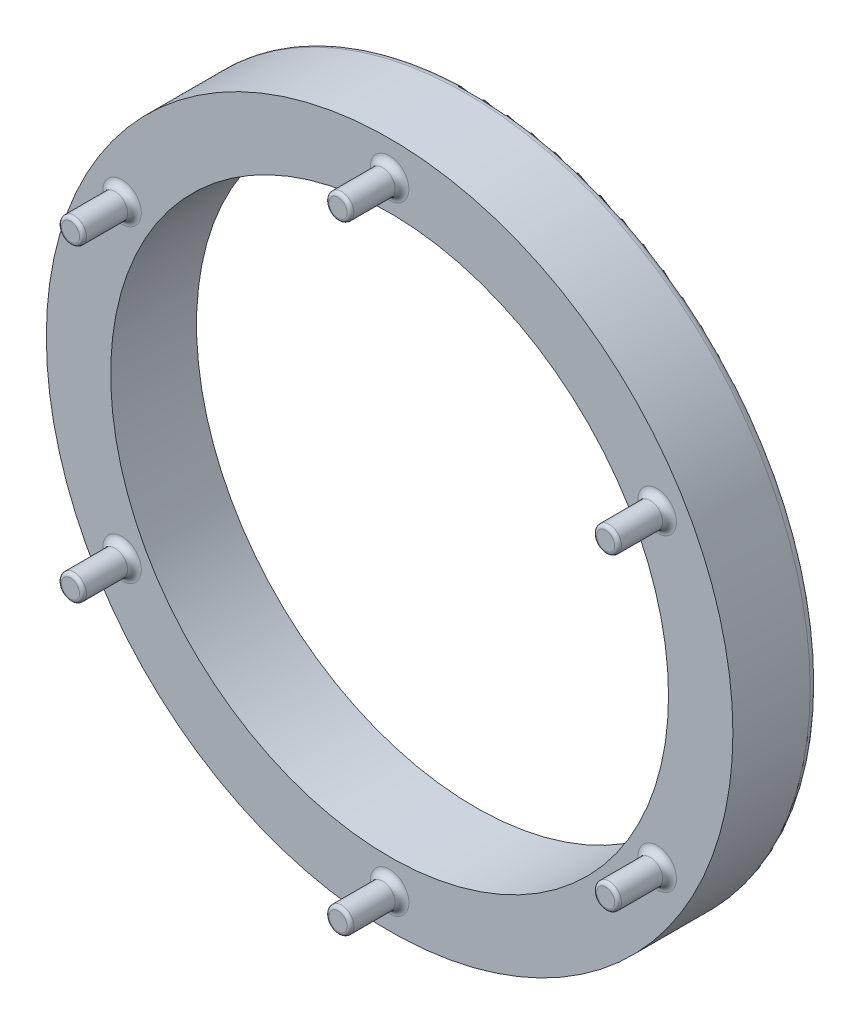
ISO-10303-21;
HEADER;
FILE_DESCRIPTION(('STEP AP214'),'2;1');
FILE_NAME('part.step','',(''),(''),'','','');
FILE_SCHEMA(('AUTOMOTIVE_DESIGN { 1 0 10303 214 1 1 1 1 }'));
ENDSEC;
DATA;
#1=APPLICATION_CONTEXT('core data for automotive mechanical design processes');
#2=APPLICATION_PROTOCOL_DEFINITION('international standard','automotive_design',2000,#1);
#3=PRODUCT_CONTEXT('',#1,'mechanical');
#4=PRODUCT('Part','Part','',(#3));
#5=PRODUCT_RELATED_PRODUCT_CATEGORY('part','',(#4));
#6=PRODUCT_DEFINITION_FORMATION('','',#4);
#7=PRODUCT_DEFINITION_CONTEXT('part definition',#1,'design');
#8=PRODUCT_DEFINITION('design','',#6,#7);
#9=PRODUCT_DEFINITION_SHAPE('','',#8);
#10=(LENGTH_UNIT() NAMED_UNIT(*) SI_UNIT(.MILLI.,.METRE.));
#11=(NAMED_UNIT(*) PLANE_ANGLE_UNIT() SI_UNIT($,.RADIAN.));
#12=(NAMED_UNIT(*) SI_UNIT($,.STERADIAN.) SOLID_ANGLE_UNIT());
#13=UNCERTAINTY_MEASURE_WITH_UNIT(LENGTH_MEASURE(1.E-05),#10,'distance_accuracy_value','');
#14=(GEOMETRIC_REPRESENTATION_CONTEXT(3) GLOBAL_UNCERTAINTY_ASSIGNED_CONTEXT((#13)) GLOBAL_UNIT_ASSIGNED_CONTEXT((#10,
#11,#12)) REPRESENTATION_CONTEXT('',''));
#15=CARTESIAN_POINT('',(0.,0.,0.));
#16=DIRECTION('',(0.,0.,1.));
#17=DIRECTION('',(1.,0.,0.));
#18=AXIS2_PLACEMENT_3D('',#15,#16,#17);
#19=CARTESIAN_POINT('',(0.,0.,5.));
#20=DIRECTION('',(0.,0.,-1.));
#21=DIRECTION('',(-1.,0.,0.));
#22=AXIS2_PLACEMENT_3D('',#19,#20,#21);
#23=CYLINDRICAL_SURFACE('',#22,20.);
#24=CARTESIAN_POINT('',(0.,0.,0.5));
#25=DIRECTION('',(0.,0.,1.));
#26=DIRECTION('',(1.,0.,0.));
#27=AXIS2_PLACEMENT_3D('',#24,#25,#26);
#28=CIRCLE('',#27,20.);
#29=CARTESIAN_POINT('',(20.,0.,0.5));
#30=VERTEX_POINT('',#29);
#31=EDGE_CURVE('E97',#30,#30,#28,.T.);
#32=ORIENTED_EDGE('',*,*,#31,.T.);
#33=EDGE_LOOP('',(#32));
#34=FACE_BOUND('',#33,.T.);
#35=CARTESIAN_POINT('',(0.,0.,5.));
#36=DIRECTION('',(0.,0.,1.));
#37=DIRECTION('',(1.,0.,0.));
#38=AXIS2_PLACEMENT_3D('',#35,#36,#37);
#39=CIRCLE('',#38,20.);
#40=CARTESIAN_POINT('',(20.,0.,5.));
#41=VERTEX_POINT('',#40);
#42=EDGE_CURVE('E149',#41,#41,#39,.T.);
#43=ORIENTED_EDGE('',*,*,#42,.F.);
#44=EDGE_LOOP('',(#43));
#45=FACE_BOUND('',#44,.T.);
#46=ADVANCED_FACE('F37',(#34,#45),#23,.T.);
#47=CARTESIAN_POINT('',(0.,0.,5.));
#48=DIRECTION('',(0.,0.,1.));
#49=DIRECTION('',(1.,0.,0.));
#50=AXIS2_PLACEMENT_3D('',#47,#48,#49);
#51=PLANE('',#50);
#52=CARTESIAN_POINT('',(0.,0.,5.));
#53=DIRECTION('',(0.,0.,1.));
#54=DIRECTION('',(1.,0.,0.));
#55=AXIS2_PLACEMENT_3D('',#52,#53,#54);
#56=CIRCLE('',#55,16.25);
#57=CARTESIAN_POINT('',(16.25,0.,5.));
#58=VERTEX_POINT('',#57);
#59=EDGE_CURVE('E153',#58,#58,#56,.T.);
#60=ORIENTED_EDGE('',*,*,#59,.F.);
#61=EDGE_LOOP('',(#60));
#62=FACE_BOUND('',#61,.T.);
#63=CARTESIAN_POINT('',(-15.5884572681184,-9.00000000000089,5.));
#64=DIRECTION('',(0.,0.,1.));
#65=DIRECTION('',(1.,0.,0.));
#66=AXIS2_PLACEMENT_3D('',#63,#64,#65);
#67=CIRCLE('',#66,1.12500000000189);
#68=CARTESIAN_POINT('',(-14.4634572681165,-9.00000000000089,5.));
#69=VERTEX_POINT('',#68);
#70=EDGE_CURVE('E121',#69,#69,#67,.F.);
#71=ORIENTED_EDGE('',*,*,#70,.T.);
#72=EDGE_LOOP('',(#71));
#73=FACE_BOUND('',#72,.T.);
#74=CARTESIAN_POINT('',(2.03974998627369E-12,-18.,5.));
#75=DIRECTION('',(0.,0.,1.));
#76=DIRECTION('',(1.,0.,0.));
#77=AXIS2_PLACEMENT_3D('',#74,#75,#76);
#78=CIRCLE('',#77,1.12500000000207);
#79=CARTESIAN_POINT('',(1.12500000000411,-18.,5.));
#80=VERTEX_POINT('',#79);
#81=EDGE_CURVE('E125',#80,#80,#78,.F.);
#82=ORIENTED_EDGE('',*,*,#81,.T.);
#83=EDGE_LOOP('',(#82));
#84=FACE_BOUND('',#83,.T.);
#85=CARTESIAN_POINT('',(15.5884572681214,-8.99999999999911,5.));
#86=DIRECTION('',(0.,0.,1.));
#87=DIRECTION('',(1.,0.,0.));
#88=AXIS2_PLACEMENT_3D('',#85,#86,#87);
#89=CIRCLE('',#88,1.12500000000129);
#90=CARTESIAN_POINT('',(16.7134572681227,-8.99999999999911,5.));
#91=VERTEX_POINT('',#90);
#92=EDGE_CURVE('E129',#91,#91,#89,.F.);
#93=ORIENTED_EDGE('',*,*,#92,.T.);
#94=EDGE_LOOP('',(#93));
#95=FACE_BOUND('',#94,.T.);
#96=CARTESIAN_POINT('',(15.5884572681204,9.00000000000089,5.));
#97=DIRECTION('',(0.,0.,1.));
#98=DIRECTION('',(1.,0.,0.));
#99=AXIS2_PLACEMENT_3D('',#96,#97,#98);
#100=CIRCLE('',#99,1.12500000000027);
#101=CARTESIAN_POINT('',(16.7134572681207,9.00000000000089,5.));
#102=VERTEX_POINT('',#101);
#103=EDGE_CURVE('E133',#102,#102,#100,.F.);
#104=ORIENTED_EDGE('',*,*,#103,.T.);
#105=EDGE_LOOP('',(#104));
#106=FACE_BOUND('',#105,.T.);
#107=CARTESIAN_POINT('',(0.,18.,5.));
#108=DIRECTION('',(0.,0.,1.));
#109=DIRECTION('',(1.,0.,0.));
#110=AXIS2_PLACEMENT_3D('',#107,#108,#109);
#111=CIRCLE('',#110,1.125);
#112=CARTESIAN_POINT('',(1.125,18.,5.));
#113=VERTEX_POINT('',#112);
#114=EDGE_CURVE('E137',#113,#113,#111,.F.);
#115=ORIENTED_EDGE('',*,*,#114,.T.);
#116=EDGE_LOOP('',(#115));
#117=FACE_BOUND('',#116,.T.);
#118=CARTESIAN_POINT('',(-15.5884572681194,8.9999999999991,5.));
#119=DIRECTION('',(0.,0.,1.));
#120=DIRECTION('',(1.,0.,0.));
#121=AXIS2_PLACEMENT_3D('',#118,#119,#120);
#122=CIRCLE('',#121,1.12500000000096);
#123=CARTESIAN_POINT('',(-14.4634572681184,8.9999999999991,5.));
#124=VERTEX_POINT('',#123);
#125=EDGE_CURVE('E141',#124,#124,#122,.F.);
#126=ORIENTED_EDGE('',*,*,#125,.T.);
#127=EDGE_LOOP('',(#126));
#128=FACE_BOUND('',#127,.T.);
#129=ORIENTED_EDGE('',*,*,#42,.T.);
#130=EDGE_LOOP('',(#129));
#131=FACE_BOUND('',#130,.T.);
#132=ADVANCED_FACE('F176',(#62,#73,#84,#95,#106,#117,#128,#131),#51,.T.);
#133=CARTESIAN_POINT('',(0.,0.,0.));
#134=DIRECTION('',(0.,0.,1.));
#135=DIRECTION('',(1.,0.,0.));
#136=AXIS2_PLACEMENT_3D('',#133,#134,#135);
#137=PLANE('',#136);
#138=CARTESIAN_POINT('',(0.,0.,0.));
#139=DIRECTION('',(0.,0.,1.));
#140=DIRECTION('',(1.,0.,0.));
#141=AXIS2_PLACEMENT_3D('',#138,#139,#140);
#142=CIRCLE('',#141,16.25);
#143=CARTESIAN_POINT('',(16.25,0.,0.));
#144=VERTEX_POINT('',#143);
#145=EDGE_CURVE('E157',#144,#144,#142,.T.);
#146=ORIENTED_EDGE('',*,*,#145,.T.);
#147=EDGE_LOOP('',(#146));
#148=FACE_BOUND('',#147,.T.);
#149=CARTESIAN_POINT('',(0.,0.,0.));
#150=DIRECTION('',(0.,0.,1.));
#151=DIRECTION('',(1.,0.,0.));
#152=AXIS2_PLACEMENT_3D('',#149,#150,#151);
#153=CIRCLE('',#152,19.5);
#154=CARTESIAN_POINT('',(19.5,0.,0.));
#155=VERTEX_POINT('',#154);
#156=EDGE_CURVE('E93',#155,#155,#153,.F.);
#157=ORIENTED_EDGE('',*,*,#156,.T.);
#158=EDGE_LOOP('',(#157));
#159=FACE_BOUND('',#158,.T.);
#160=ADVANCED_FACE('F162',(#148,#159),#137,.F.);
#161=CARTESIAN_POINT('',(0.,18.,8.));
#162=DIRECTION('',(0.,0.,-1.));
#163=DIRECTION('',(-1.,0.,0.));
#164=AXIS2_PLACEMENT_3D('',#161,#162,#163);
#165=CYLINDRICAL_SURFACE('',#164,0.725);
#166=CARTESIAN_POINT('',(0.,18.,7.8));
#167=DIRECTION('',(0.,0.,1.));
#168=DIRECTION('',(1.,0.,0.));
#169=AXIS2_PLACEMENT_3D('',#166,#167,#168);
#170=CIRCLE('',#169,0.725);
#171=CARTESIAN_POINT('',(0.725,18.,7.8));
#172=VERTEX_POINT('',#171);
#173=EDGE_CURVE('E85',#172,#172,#170,.F.);
#174=ORIENTED_EDGE('',*,*,#173,.T.);
#175=EDGE_LOOP('',(#174));
#176=FACE_BOUND('',#175,.T.);
#177=CARTESIAN_POINT('',(0.,18.,5.4));
#178=DIRECTION('',(0.,0.,1.));
#179=DIRECTION('',(1.,0.,0.));
#180=AXIS2_PLACEMENT_3D('',#177,#178,#179);
#181=CIRCLE('',#180,0.725);
#182=CARTESIAN_POINT('',(0.725,18.,5.4));
#183=VERTEX_POINT('',#182);
#184=EDGE_CURVE('E105',#183,#183,#181,.T.);
#185=ORIENTED_EDGE('',*,*,#184,.T.);
#186=EDGE_LOOP('',(#185));
#187=FACE_BOUND('',#186,.T.);
#188=ADVANCED_FACE('F272',(#176,#187),#165,.T.);
#189=CARTESIAN_POINT('',(0.,18.,8.));
#190=DIRECTION('',(0.,0.,1.));
#191=DIRECTION('',(1.,0.,0.));
#192=AXIS2_PLACEMENT_3D('',#189,#190,#191);
#193=PLANE('',#192);
#194=CARTESIAN_POINT('',(0.,18.,8.));
#195=DIRECTION('',(0.,0.,1.));
#196=DIRECTION('',(1.,0.,0.));
#197=AXIS2_PLACEMENT_3D('',#194,#195,#196);
#198=CIRCLE('',#197,0.525);
#199=CARTESIAN_POINT('',(0.525,18.,8.));
#200=VERTEX_POINT('',#199);
#201=EDGE_CURVE('E89',#200,#200,#198,.T.);
#202=ORIENTED_EDGE('',*,*,#201,.T.);
#203=EDGE_LOOP('',(#202));
#204=FACE_BOUND('',#203,.T.);
#205=ADVANCED_FACE('F269',(#204),#193,.T.);
#206=CARTESIAN_POINT('',(15.5884572681204,9.00000000000089,8.));
#207=DIRECTION('',(0.,0.,-1.));
#208=DIRECTION('',(-1.,0.,0.));
#209=AXIS2_PLACEMENT_3D('',#206,#207,#208);
#210=CYLINDRICAL_SURFACE('',#209,0.725000000000274);
#211=CARTESIAN_POINT('',(15.5884572681204,9.00000000000089,7.8));
#212=DIRECTION('',(0.,0.,1.));
#213=DIRECTION('',(1.,0.,0.));
#214=AXIS2_PLACEMENT_3D('',#211,#212,#213);
#215=CIRCLE('',#214,0.725000000000274);
#216=CARTESIAN_POINT('',(16.3134572681207,9.00000000000089,7.8));
#217=VERTEX_POINT('',#216);
#218=EDGE_CURVE('E10',#217,#217,#215,.F.);
#219=ORIENTED_EDGE('',*,*,#218,.T.);
#220=EDGE_LOOP('',(#219));
#221=FACE_BOUND('',#220,.T.);
#222=CARTESIAN_POINT('',(15.5884572681204,9.00000000000089,5.4));
#223=DIRECTION('',(0.,0.,1.));
#224=DIRECTION('',(1.,0.,0.));
#225=AXIS2_PLACEMENT_3D('',#222,#223,#224);
#226=CIRCLE('',#225,0.725000000000274);
#227=CARTESIAN_POINT('',(16.3134572681207,9.00000000000089,5.4));
#228=VERTEX_POINT('',#227);
#229=EDGE_CURVE('E109',#228,#228,#226,.T.);
#230=ORIENTED_EDGE('',*,*,#229,.T.);
#231=EDGE_LOOP('',(#230));
#232=FACE_BOUND('',#231,.T.);
#233=ADVANCED_FACE('F266',(#221,#232),#210,.T.);
#234=CARTESIAN_POINT('',(15.5884572681204,9.00000000000089,8.));
#235=DIRECTION('',(0.,0.,1.));
#236=DIRECTION('',(1.,0.,0.));
#237=AXIS2_PLACEMENT_3D('',#234,#235,#236);
#238=PLANE('',#237);
#239=CARTESIAN_POINT('',(15.5884572681204,9.00000000000089,8.));
#240=DIRECTION('',(0.,0.,1.));
#241=DIRECTION('',(1.,0.,0.));
#242=AXIS2_PLACEMENT_3D('',#239,#240,#241);
#243=CIRCLE('',#242,0.525000000000274);
#244=CARTESIAN_POINT('',(16.1134572681207,9.00000000000089,8.));
#245=VERTEX_POINT('',#244);
#246=EDGE_CURVE('E45',#245,#245,#243,.T.);
#247=ORIENTED_EDGE('',*,*,#246,.T.);
#248=EDGE_LOOP('',(#247));
#249=FACE_BOUND('',#248,.T.);
#250=ADVANCED_FACE('F262',(#249),#238,.T.);
#251=CARTESIAN_POINT('',(15.5884572681214,-8.99999999999911,8.));
#252=DIRECTION('',(0.,0.,-1.));
#253=DIRECTION('',(-1.,0.,0.));
#254=AXIS2_PLACEMENT_3D('',#251,#252,#253);
#255=CYLINDRICAL_SURFACE('',#254,0.725000000001288);
#256=CARTESIAN_POINT('',(15.5884572681214,-8.99999999999911,7.8));
#257=DIRECTION('',(0.,0.,1.));
#258=DIRECTION('',(1.,0.,0.));
#259=AXIS2_PLACEMENT_3D('',#256,#257,#258);
#260=CIRCLE('',#259,0.725000000001288);
#261=CARTESIAN_POINT('',(16.3134572681227,-8.99999999999911,7.8));
#262=VERTEX_POINT('',#261);
#263=EDGE_CURVE('E61',#262,#262,#260,.F.);
#264=ORIENTED_EDGE('',*,*,#263,.T.);
#265=EDGE_LOOP('',(#264));
#266=FACE_BOUND('',#265,.T.);
#267=CARTESIAN_POINT('',(15.5884572681214,-8.99999999999911,5.4));
#268=DIRECTION('',(0.,0.,1.));
#269=DIRECTION('',(1.,0.,0.));
#270=AXIS2_PLACEMENT_3D('',#267,#268,#269);
#271=CIRCLE('',#270,0.725000000001288);
#272=CARTESIAN_POINT('',(16.3134572681227,-8.99999999999911,5.4));
#273=VERTEX_POINT('',#272);
#274=EDGE_CURVE('E113',#273,#273,#271,.T.);
#275=ORIENTED_EDGE('',*,*,#274,.T.);
#276=EDGE_LOOP('',(#275));
#277=FACE_BOUND('',#276,.T.);
#278=ADVANCED_FACE('F258',(#266,#277),#255,.T.);
#279=CARTESIAN_POINT('',(15.5884572681214,-8.99999999999911,8.));
#280=DIRECTION('',(0.,0.,1.));
#281=DIRECTION('',(1.,0.,0.));
#282=AXIS2_PLACEMENT_3D('',#279,#280,#281);
#283=PLANE('',#282);
#284=CARTESIAN_POINT('',(15.5884572681214,-8.99999999999911,8.));
#285=DIRECTION('',(0.,0.,1.));
#286=DIRECTION('',(1.,0.,0.));
#287=AXIS2_PLACEMENT_3D('',#284,#285,#286);
#288=CIRCLE('',#287,0.525000000001288);
#289=CARTESIAN_POINT('',(16.1134572681227,-8.99999999999911,8.));
#290=VERTEX_POINT('',#289);
#291=EDGE_CURVE('E65',#290,#290,#288,.T.);
#292=ORIENTED_EDGE('',*,*,#291,.T.);
#293=EDGE_LOOP('',(#292));
#294=FACE_BOUND('',#293,.T.);
#295=ADVANCED_FACE('F251',(#294),#283,.T.);
#296=CARTESIAN_POINT('',(2.03974998627369E-12,-18.,8.));
#297=DIRECTION('',(0.,0.,-1.));
#298=DIRECTION('',(-1.,0.,0.));
#299=AXIS2_PLACEMENT_3D('',#296,#297,#298);
#300=CYLINDRICAL_SURFACE('',#299,0.725000000002071);
#301=CARTESIAN_POINT('',(2.03974998627369E-12,-18.,7.8));
#302=DIRECTION('',(0.,0.,1.));
#303=DIRECTION('',(1.,0.,0.));
#304=AXIS2_PLACEMENT_3D('',#301,#302,#303);
#305=CIRCLE('',#304,0.725000000002071);
#306=CARTESIAN_POINT('',(0.725000000004111,-18.,7.8));
#307=VERTEX_POINT('',#306);
#308=EDGE_CURVE('E50',#307,#307,#305,.F.);
#309=ORIENTED_EDGE('',*,*,#308,.T.);
#310=EDGE_LOOP('',(#309));
#311=FACE_BOUND('',#310,.T.);
#312=CARTESIAN_POINT('',(2.03974998627369E-12,-18.,5.4));
#313=DIRECTION('',(0.,0.,1.));
#314=DIRECTION('',(1.,0.,0.));
#315=AXIS2_PLACEMENT_3D('',#312,#313,#314);
#316=CIRCLE('',#315,0.725000000002071);
#317=CARTESIAN_POINT('',(0.725000000004111,-18.,5.4));
#318=VERTEX_POINT('',#317);
#319=EDGE_CURVE('E117',#318,#318,#316,.T.);
#320=ORIENTED_EDGE('',*,*,#319,.T.);
#321=EDGE_LOOP('',(#320));
#322=FACE_BOUND('',#321,.T.);
#323=ADVANCED_FACE('F242',(#311,#322),#300,.T.);
#324=CARTESIAN_POINT('',(2.03974998627369E-12,-18.,8.));
#325=DIRECTION('',(0.,0.,1.));
#326=DIRECTION('',(1.,0.,0.));
#327=AXIS2_PLACEMENT_3D('',#324,#325,#326);
#328=PLANE('',#327);
#329=CARTESIAN_POINT('',(2.03974998627369E-12,-18.,8.));
#330=DIRECTION('',(0.,0.,1.));
#331=DIRECTION('',(1.,0.,0.));
#332=AXIS2_PLACEMENT_3D('',#329,#330,#331);
#333=CIRCLE('',#332,0.525000000002071);
#334=CARTESIAN_POINT('',(0.525000000004111,-18.,8.));
#335=VERTEX_POINT('',#334);
#336=EDGE_CURVE('E55',#335,#335,#333,.T.);
#337=ORIENTED_EDGE('',*,*,#336,.T.);
#338=EDGE_LOOP('',(#337));
#339=FACE_BOUND('',#338,.T.);
#340=ADVANCED_FACE('F239',(#339),#328,.T.);
#341=CARTESIAN_POINT('',(-15.5884572681184,-9.00000000000089,8.));
#342=DIRECTION('',(0.,0.,-1.));
#343=DIRECTION('',(-1.,0.,0.));
#344=AXIS2_PLACEMENT_3D('',#341,#342,#343);
#345=CYLINDRICAL_SURFACE('',#344,0.725000000001887);
#346=CARTESIAN_POINT('',(-15.5884572681184,-9.00000000000089,7.8));
#347=DIRECTION('',(0.,0.,1.));
#348=DIRECTION('',(1.,0.,0.));
#349=AXIS2_PLACEMENT_3D('',#346,#347,#348);
#350=CIRCLE('',#349,0.725000000001887);
#351=CARTESIAN_POINT('',(-14.8634572681165,-9.00000000000089,7.8));
#352=VERTEX_POINT('',#351);
#353=EDGE_CURVE('E69',#352,#352,#350,.F.);
#354=ORIENTED_EDGE('',*,*,#353,.T.);
#355=EDGE_LOOP('',(#354));
#356=FACE_BOUND('',#355,.T.);
#357=CARTESIAN_POINT('',(-15.5884572681184,-9.00000000000089,5.4));
#358=DIRECTION('',(0.,0.,1.));
#359=DIRECTION('',(1.,0.,0.));
#360=AXIS2_PLACEMENT_3D('',#357,#358,#359);
#361=CIRCLE('',#360,0.725000000001887);
#362=CARTESIAN_POINT('',(-14.8634572681165,-9.00000000000089,5.4));
#363=VERTEX_POINT('',#362);
#364=EDGE_CURVE('E145',#363,#363,#361,.T.);
#365=ORIENTED_EDGE('',*,*,#364,.T.);
#366=EDGE_LOOP('',(#365));
#367=FACE_BOUND('',#366,.T.);
#368=ADVANCED_FACE('F241',(#356,#367),#345,.T.);
#369=CARTESIAN_POINT('',(-15.5884572681184,-9.00000000000089,8.));
#370=DIRECTION('',(0.,0.,1.));
#371=DIRECTION('',(1.,0.,0.));
#372=AXIS2_PLACEMENT_3D('',#369,#370,#371);
#373=PLANE('',#372);
#374=CARTESIAN_POINT('',(-15.5884572681184,-9.00000000000089,8.));
#375=DIRECTION('',(0.,0.,1.));
#376=DIRECTION('',(1.,0.,0.));
#377=AXIS2_PLACEMENT_3D('',#374,#375,#376);
#378=CIRCLE('',#377,0.525000000001887);
#379=CARTESIAN_POINT('',(-15.0634572681165,-9.00000000000089,8.));
#380=VERTEX_POINT('',#379);
#381=EDGE_CURVE('E73',#380,#380,#378,.T.);
#382=ORIENTED_EDGE('',*,*,#381,.T.);
#383=EDGE_LOOP('',(#382));
#384=FACE_BOUND('',#383,.T.);
#385=ADVANCED_FACE('F248',(#384),#373,.T.);
#386=CARTESIAN_POINT('',(-15.5884572681194,8.9999999999991,8.));
#387=DIRECTION('',(0.,0.,-1.));
#388=DIRECTION('',(-1.,0.,0.));
#389=AXIS2_PLACEMENT_3D('',#386,#387,#388);
#390=CYLINDRICAL_SURFACE('',#389,0.725000000000959);
#391=CARTESIAN_POINT('',(-15.5884572681194,8.9999999999991,7.8));
#392=DIRECTION('',(0.,0.,1.));
#393=DIRECTION('',(1.,0.,0.));
#394=AXIS2_PLACEMENT_3D('',#391,#392,#393);
#395=CIRCLE('',#394,0.725000000000959);
#396=CARTESIAN_POINT('',(-14.8634572681184,8.9999999999991,7.8));
#397=VERTEX_POINT('',#396);
#398=EDGE_CURVE('E77',#397,#397,#395,.F.);
#399=ORIENTED_EDGE('',*,*,#398,.T.);
#400=EDGE_LOOP('',(#399));
#401=FACE_BOUND('',#400,.T.);
#402=CARTESIAN_POINT('',(-15.5884572681194,8.9999999999991,5.4));
#403=DIRECTION('',(0.,0.,1.));
#404=DIRECTION('',(1.,0.,0.));
#405=AXIS2_PLACEMENT_3D('',#402,#403,#404);
#406=CIRCLE('',#405,0.725000000000959);
#407=CARTESIAN_POINT('',(-14.8634572681184,8.9999999999991,5.4));
#408=VERTEX_POINT('',#407);
#409=EDGE_CURVE('E101',#408,#408,#406,.T.);
#410=ORIENTED_EDGE('',*,*,#409,.T.);
#411=EDGE_LOOP('',(#410));
#412=FACE_BOUND('',#411,.T.);
#413=ADVANCED_FACE('F337',(#401,#412),#390,.T.);
#414=CARTESIAN_POINT('',(-15.5884572681194,8.9999999999991,8.));
#415=DIRECTION('',(0.,0.,1.));
#416=DIRECTION('',(1.,0.,0.));
#417=AXIS2_PLACEMENT_3D('',#414,#415,#416);
#418=PLANE('',#417);
#419=CARTESIAN_POINT('',(-15.5884572681194,8.9999999999991,8.));
#420=DIRECTION('',(0.,0.,1.));
#421=DIRECTION('',(1.,0.,0.));
#422=AXIS2_PLACEMENT_3D('',#419,#420,#421);
#423=CIRCLE('',#422,0.525000000000959);
#424=CARTESIAN_POINT('',(-15.0634572681184,8.9999999999991,8.));
#425=VERTEX_POINT('',#424);
#426=EDGE_CURVE('E81',#425,#425,#423,.T.);
#427=ORIENTED_EDGE('',*,*,#426,.T.);
#428=EDGE_LOOP('',(#427));
#429=FACE_BOUND('',#428,.T.);
#430=ADVANCED_FACE('F191',(#429),#418,.T.);
#431=CARTESIAN_POINT('',(-15.5884572681184,-9.00000000000089,5.4));
#432=DIRECTION('',(0.,0.,1.));
#433=DIRECTION('',(1.,0.,0.));
#434=AXIS2_PLACEMENT_3D('',#431,#432,#433);
#435=TOROIDAL_SURFACE('',#434,1.12500000000189,0.4);
#436=ORIENTED_EDGE('',*,*,#70,.F.);
#437=EDGE_LOOP('',(#436));
#438=FACE_BOUND('',#437,.T.);
#439=ORIENTED_EDGE('',*,*,#364,.F.);
#440=EDGE_LOOP('',(#439));
#441=FACE_BOUND('',#440,.T.);
#442=ADVANCED_FACE('F187',(#438,#441),#435,.F.);
#443=CARTESIAN_POINT('',(2.03974998627369E-12,-18.,5.4));
#444=DIRECTION('',(0.,0.,1.));
#445=DIRECTION('',(1.,0.,0.));
#446=AXIS2_PLACEMENT_3D('',#443,#444,#445);
#447=TOROIDAL_SURFACE('',#446,1.12500000000207,0.4);
#448=ORIENTED_EDGE('',*,*,#81,.F.);
#449=EDGE_LOOP('',(#448));
#450=FACE_BOUND('',#449,.T.);
#451=ORIENTED_EDGE('',*,*,#319,.F.);
#452=EDGE_LOOP('',(#451));
#453=FACE_BOUND('',#452,.T.);
#454=ADVANCED_FACE('F190',(#450,#453),#447,.F.);
#455=CARTESIAN_POINT('',(15.5884572681214,-8.99999999999911,5.4));
#456=DIRECTION('',(0.,0.,1.));
#457=DIRECTION('',(1.,0.,0.));
#458=AXIS2_PLACEMENT_3D('',#455,#456,#457);
#459=TOROIDAL_SURFACE('',#458,1.12500000000129,0.4);
#460=ORIENTED_EDGE('',*,*,#92,.F.);
#461=EDGE_LOOP('',(#460));
#462=FACE_BOUND('',#461,.T.);
#463=ORIENTED_EDGE('',*,*,#274,.F.);
#464=EDGE_LOOP('',(#463));
#465=FACE_BOUND('',#464,.T.);
#466=ADVANCED_FACE('F195',(#462,#465),#459,.F.);
#467=CARTESIAN_POINT('',(15.5884572681204,9.00000000000089,5.4));
#468=DIRECTION('',(0.,0.,1.));
#469=DIRECTION('',(1.,0.,0.));
#470=AXIS2_PLACEMENT_3D('',#467,#468,#469);
#471=TOROIDAL_SURFACE('',#470,1.12500000000027,0.4);
#472=ORIENTED_EDGE('',*,*,#103,.F.);
#473=EDGE_LOOP('',(#472));
#474=FACE_BOUND('',#473,.T.);
#475=ORIENTED_EDGE('',*,*,#229,.F.);
#476=EDGE_LOOP('',(#475));
#477=FACE_BOUND('',#476,.T.);
#478=ADVANCED_FACE('F199',(#474,#477),#471,.F.);
#479=CARTESIAN_POINT('',(0.,18.,5.4));
#480=DIRECTION('',(0.,0.,1.));
#481=DIRECTION('',(1.,0.,0.));
#482=AXIS2_PLACEMENT_3D('',#479,#480,#481);
#483=TOROIDAL_SURFACE('',#482,1.125,0.4);
#484=ORIENTED_EDGE('',*,*,#114,.F.);
#485=EDGE_LOOP('',(#484));
#486=FACE_BOUND('',#485,.T.);
#487=ORIENTED_EDGE('',*,*,#184,.F.);
#488=EDGE_LOOP('',(#487));
#489=FACE_BOUND('',#488,.T.);
#490=ADVANCED_FACE('F203',(#486,#489),#483,.F.);
#491=CARTESIAN_POINT('',(-15.5884572681194,8.9999999999991,5.4));
#492=DIRECTION('',(0.,0.,1.));
#493=DIRECTION('',(1.,0.,0.));
#494=AXIS2_PLACEMENT_3D('',#491,#492,#493);
#495=TOROIDAL_SURFACE('',#494,1.12500000000096,0.4);
#496=ORIENTED_EDGE('',*,*,#125,.F.);
#497=EDGE_LOOP('',(#496));
#498=FACE_BOUND('',#497,.T.);
#499=ORIENTED_EDGE('',*,*,#409,.F.);
#500=EDGE_LOOP('',(#499));
#501=FACE_BOUND('',#500,.T.);
#502=ADVANCED_FACE('F207',(#498,#501),#495,.F.);
#503=CARTESIAN_POINT('',(0.,0.,0.5));
#504=DIRECTION('',(0.,0.,1.));
#505=DIRECTION('',(1.,0.,0.));
#506=AXIS2_PLACEMENT_3D('',#503,#504,#505);
#507=TOROIDAL_SURFACE('',#506,19.5,0.5);
#508=ORIENTED_EDGE('',*,*,#156,.F.);
#509=EDGE_LOOP('',(#508));
#510=FACE_BOUND('',#509,.T.);
#511=ORIENTED_EDGE('',*,*,#31,.F.);
#512=EDGE_LOOP('',(#511));
#513=FACE_BOUND('',#512,.T.);
#514=ADVANCED_FACE('F211',(#510,#513),#507,.T.);
#515=CARTESIAN_POINT('',(0.,18.,7.8));
#516=DIRECTION('',(0.,0.,1.));
#517=DIRECTION('',(1.,0.,0.));
#518=AXIS2_PLACEMENT_3D('',#515,#516,#517);
#519=TOROIDAL_SURFACE('',#518,0.525,0.2);
#520=ORIENTED_EDGE('',*,*,#173,.F.);
#521=EDGE_LOOP('',(#520));
#522=FACE_BOUND('',#521,.T.);
#523=ORIENTED_EDGE('',*,*,#201,.F.);
#524=EDGE_LOOP('',(#523));
#525=FACE_BOUND('',#524,.T.);
#526=ADVANCED_FACE('F215',(#522,#525),#519,.T.);
#527=CARTESIAN_POINT('',(-15.5884572681194,8.9999999999991,7.8));
#528=DIRECTION('',(0.,0.,1.));
#529=DIRECTION('',(1.,0.,0.));
#530=AXIS2_PLACEMENT_3D('',#527,#528,#529);
#531=TOROIDAL_SURFACE('',#530,0.525000000000959,0.2);
#532=ORIENTED_EDGE('',*,*,#398,.F.);
#533=EDGE_LOOP('',(#532));
#534=FACE_BOUND('',#533,.T.);
#535=ORIENTED_EDGE('',*,*,#426,.F.);
#536=EDGE_LOOP('',(#535));
#537=FACE_BOUND('',#536,.T.);
#538=ADVANCED_FACE('F219',(#534,#537),#531,.T.);
#539=CARTESIAN_POINT('',(-15.5884572681184,-9.00000000000089,7.8));
#540=DIRECTION('',(0.,0.,1.));
#541=DIRECTION('',(1.,0.,0.));
#542=AXIS2_PLACEMENT_3D('',#539,#540,#541);
#543=TOROIDAL_SURFACE('',#542,0.525000000001887,0.2);
#544=ORIENTED_EDGE('',*,*,#353,.F.);
#545=EDGE_LOOP('',(#544));
#546=FACE_BOUND('',#545,.T.);
#547=ORIENTED_EDGE('',*,*,#381,.F.);
#548=EDGE_LOOP('',(#547));
#549=FACE_BOUND('',#548,.T.);
#550=ADVANCED_FACE('F223',(#546,#549),#543,.T.);
#551=CARTESIAN_POINT('',(15.5884572681214,-8.99999999999911,7.8));
#552=DIRECTION('',(0.,0.,1.));
#553=DIRECTION('',(1.,0.,0.));
#554=AXIS2_PLACEMENT_3D('',#551,#552,#553);
#555=TOROIDAL_SURFACE('',#554,0.525000000001288,0.2);
#556=ORIENTED_EDGE('',*,*,#263,.F.);
#557=EDGE_LOOP('',(#556));
#558=FACE_BOUND('',#557,.T.);
#559=ORIENTED_EDGE('',*,*,#291,.F.);
#560=EDGE_LOOP('',(#559));
#561=FACE_BOUND('',#560,.T.);
#562=ADVANCED_FACE('F227',(#558,#561),#555,.T.);
#563=CARTESIAN_POINT('',(2.03974998627369E-12,-18.,7.8));
#564=DIRECTION('',(0.,0.,1.));
#565=DIRECTION('',(1.,0.,0.));
#566=AXIS2_PLACEMENT_3D('',#563,#564,#565);
#567=TOROIDAL_SURFACE('',#566,0.525000000002071,0.2);
#568=ORIENTED_EDGE('',*,*,#308,.F.);
#569=EDGE_LOOP('',(#568));
#570=FACE_BOUND('',#569,.T.);
#571=ORIENTED_EDGE('',*,*,#336,.F.);
#572=EDGE_LOOP('',(#571));
#573=FACE_BOUND('',#572,.T.);
#574=ADVANCED_FACE('F172',(#570,#573),#567,.T.);
#575=CARTESIAN_POINT('',(15.5884572681204,9.00000000000089,7.8));
#576=DIRECTION('',(0.,0.,1.));
#577=DIRECTION('',(1.,0.,0.));
#578=AXIS2_PLACEMENT_3D('',#575,#576,#577);
#579=TOROIDAL_SURFACE('',#578,0.525000000000274,0.2);
#580=ORIENTED_EDGE('',*,*,#218,.F.);
#581=EDGE_LOOP('',(#580));
#582=FACE_BOUND('',#581,.T.);
#583=ORIENTED_EDGE('',*,*,#246,.F.);
#584=EDGE_LOOP('',(#583));
#585=FACE_BOUND('',#584,.T.);
#586=ADVANCED_FACE('F39',(#582,#585),#579,.T.);
#587=CARTESIAN_POINT('',(0.,0.,4.));
#588=DIRECTION('',(0.,0.,1.));
#589=DIRECTION('',(1.,0.,0.));
#590=AXIS2_PLACEMENT_3D('',#587,#588,#589);
#591=CYLINDRICAL_SURFACE('',#590,16.25);
#592=ORIENTED_EDGE('',*,*,#59,.T.);
#593=EDGE_LOOP('',(#592));
#594=FACE_BOUND('',#593,.T.);
#595=ORIENTED_EDGE('',*,*,#145,.F.);
#596=EDGE_LOOP('',(#595));
#597=FACE_BOUND('',#596,.T.);
#598=ADVANCED_FACE('F165',(#594,#597),#591,.F.);
#599=CLOSED_SHELL('',(#46,#132,#160,#188,#205,#233,#250,#278,#295,#323,#340,#368,#385,#413,#430,
#442,#454,#466,#478,#490,#502,#514,#526,#538,#550,#562,#574,#586,#598));
#600=MANIFOLD_SOLID_BREP('B2',#599);
#601=ADVANCED_BREP_SHAPE_REPRESENTATION('',(#18,#600),#14);
#602=SHAPE_DEFINITION_REPRESENTATION(#9,#601);
ENDSEC;
END-ISO-10303-21;
